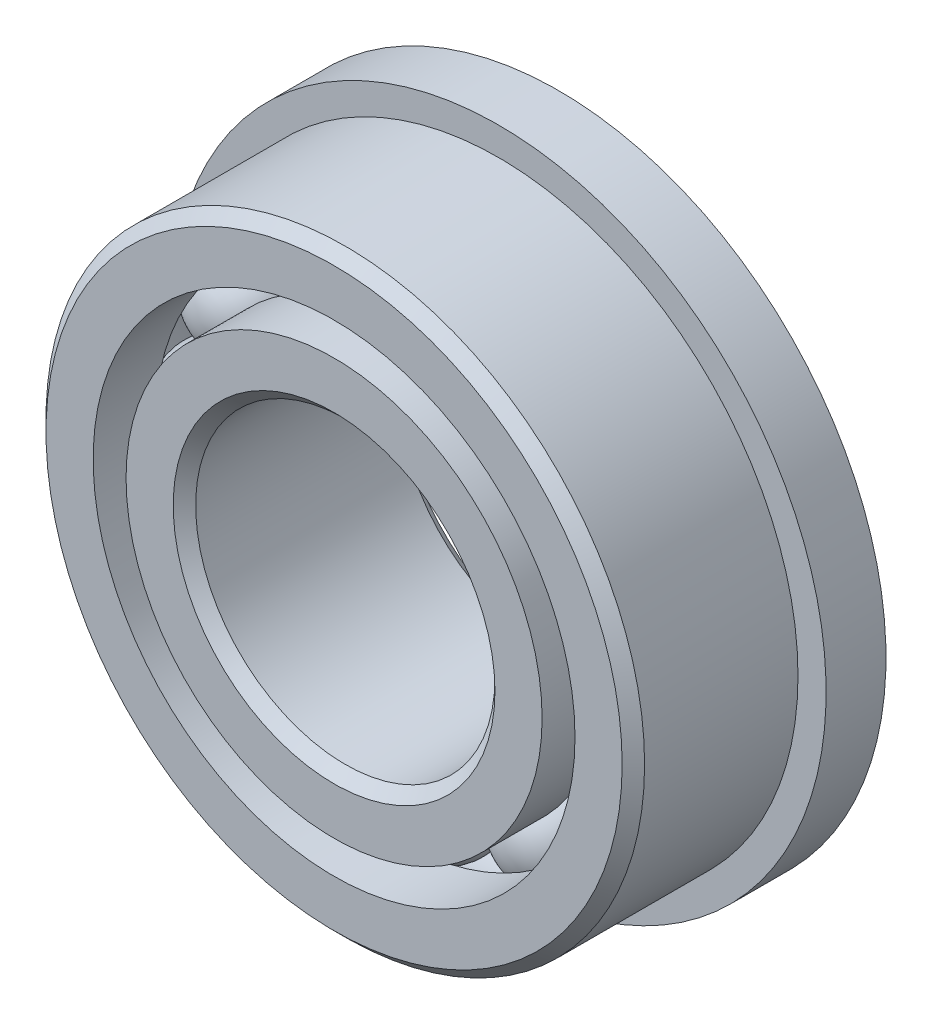
ISO-10303-21;
HEADER;
FILE_DESCRIPTION(('STEP AP214'),'2;1');
FILE_NAME('part.step','',(''),(''),'','','');
FILE_SCHEMA(('AUTOMOTIVE_DESIGN { 1 0 10303 214 1 1 1 1 }'));
ENDSEC;
DATA;
#1=APPLICATION_CONTEXT('core data for automotive mechanical design processes');
#2=APPLICATION_PROTOCOL_DEFINITION('international standard','automotive_design',2000,#1);
#3=PRODUCT_CONTEXT('',#1,'mechanical');
#4=PRODUCT('Part','Part','',(#3));
#5=PRODUCT_RELATED_PRODUCT_CATEGORY('part','',(#4));
#6=PRODUCT_DEFINITION_FORMATION('','',#4);
#7=PRODUCT_DEFINITION_CONTEXT('part definition',#1,'design');
#8=PRODUCT_DEFINITION('design','',#6,#7);
#9=PRODUCT_DEFINITION_SHAPE('','',#8);
#10=(LENGTH_UNIT() NAMED_UNIT(*) SI_UNIT(.MILLI.,.METRE.));
#11=(NAMED_UNIT(*) PLANE_ANGLE_UNIT() SI_UNIT($,.RADIAN.));
#12=(NAMED_UNIT(*) SI_UNIT($,.STERADIAN.) SOLID_ANGLE_UNIT());
#13=UNCERTAINTY_MEASURE_WITH_UNIT(LENGTH_MEASURE(1.E-05),#10,'distance_accuracy_value','');
#14=(GEOMETRIC_REPRESENTATION_CONTEXT(3) GLOBAL_UNCERTAINTY_ASSIGNED_CONTEXT((#13)) GLOBAL_UNIT_ASSIGNED_CONTEXT((#10,
#11,#12)) REPRESENTATION_CONTEXT('',''));
#15=CARTESIAN_POINT('',(0.,0.,0.));
#16=DIRECTION('',(0.,0.,1.));
#17=DIRECTION('',(1.,0.,0.));
#18=AXIS2_PLACEMENT_3D('',#15,#16,#17);
#19=CARTESIAN_POINT('',(-2.38124999999995,4.12444598552342,0.));
#20=DIRECTION('',(0.,0.,1.));
#21=DIRECTION('',(-0.499999999999989,0.866025403784445,0.));
#22=AXIS2_PLACEMENT_3D('',#19,#20,#21);
#23=SPHERICAL_SURFACE('',#22,1.11436144103197);
#24=CARTESIAN_POINT('',(-2.38124999999995,4.12444598552342,1.11436144103197));
#25=VERTEX_POINT('',#24);
#26=VERTEX_LOOP('',#25);
#27=FACE_BOUND('',#26,.T.);
#28=ADVANCED_FACE('F37',(#27),#23,.T.);
#29=CLOSED_SHELL('',(#28));
#30=MANIFOLD_SOLID_BREP('B2',#29);
#31=CARTESIAN_POINT('',(-4.12444598552336,2.38125000000005,0.));
#32=DIRECTION('',(0.,0.,1.));
#33=DIRECTION('',(-0.866025403784433,0.50000000000001,0.));
#34=AXIS2_PLACEMENT_3D('',#31,#32,#33);
#35=SPHERICAL_SURFACE('',#34,1.11436144103197);
#36=CARTESIAN_POINT('',(-4.12444598552336,2.38125000000005,1.11436144103197));
#37=VERTEX_POINT('',#36);
#38=VERTEX_LOOP('',#37);
#39=FACE_BOUND('',#38,.T.);
#40=ADVANCED_FACE('F57',(#39),#35,.T.);
#41=CLOSED_SHELL('',(#40));
#42=MANIFOLD_SOLID_BREP('B6',#41);
#43=CARTESIAN_POINT('',(-4.7625,0.,0.));
#44=DIRECTION('',(0.,0.,1.));
#45=DIRECTION('',(-1.,0.,0.));
#46=AXIS2_PLACEMENT_3D('',#43,#44,#45);
#47=SPHERICAL_SURFACE('',#46,1.11436144103197);
#48=CARTESIAN_POINT('',(-4.7625,0.,1.11436144103197));
#49=VERTEX_POINT('',#48);
#50=VERTEX_LOOP('',#49);
#51=FACE_BOUND('',#50,.T.);
#52=ADVANCED_FACE('F77',(#51),#47,.T.);
#53=CLOSED_SHELL('',(#52));
#54=MANIFOLD_SOLID_BREP('B33',#53);
#55=CARTESIAN_POINT('',(-4.12444598552341,-2.38124999999996,0.));
#56=DIRECTION('',(0.,0.,1.));
#57=DIRECTION('',(-0.866025403784443,-0.499999999999992,0.));
#58=AXIS2_PLACEMENT_3D('',#55,#56,#57);
#59=SPHERICAL_SURFACE('',#58,1.11436144103197);
#60=CARTESIAN_POINT('',(-4.12444598552341,-2.38124999999996,1.11436144103197));
#61=VERTEX_POINT('',#60);
#62=VERTEX_LOOP('',#61);
#63=FACE_BOUND('',#62,.T.);
#64=ADVANCED_FACE('F97',(#63),#59,.T.);
#65=CLOSED_SHELL('',(#64));
#66=MANIFOLD_SOLID_BREP('B53',#65);
#67=CARTESIAN_POINT('',(-2.38125000000003,-4.12444598552337,0.));
#68=DIRECTION('',(0.,0.,1.));
#69=DIRECTION('',(-0.500000000000007,-0.866025403784435,0.));
#70=AXIS2_PLACEMENT_3D('',#67,#68,#69);
#71=SPHERICAL_SURFACE('',#70,1.11436144103197);
#72=CARTESIAN_POINT('',(-2.38125000000003,-4.12444598552337,1.11436144103197));
#73=VERTEX_POINT('',#72);
#74=VERTEX_LOOP('',#73);
#75=FACE_BOUND('',#74,.T.);
#76=ADVANCED_FACE('F117',(#75),#71,.T.);
#77=CLOSED_SHELL('',(#76));
#78=MANIFOLD_SOLID_BREP('B73',#77);
#79=CARTESIAN_POINT('',(0.,-4.7625,0.));
#80=DIRECTION('',(0.,0.,1.));
#81=DIRECTION('',(0.,-1.,0.));
#82=AXIS2_PLACEMENT_3D('',#79,#80,#81);
#83=SPHERICAL_SURFACE('',#82,1.11436144103197);
#84=CARTESIAN_POINT('',(0.,-4.7625,1.11436144103197));
#85=VERTEX_POINT('',#84);
#86=VERTEX_LOOP('',#85);
#87=FACE_BOUND('',#86,.T.);
#88=ADVANCED_FACE('F137',(#87),#83,.T.);
#89=CLOSED_SHELL('',(#88));
#90=MANIFOLD_SOLID_BREP('B93',#89);
#91=CARTESIAN_POINT('',(2.38124999999998,-4.1244459855234,0.));
#92=DIRECTION('',(0.,0.,1.));
#93=DIRECTION('',(0.499999999999995,-0.866025403784442,0.));
#94=AXIS2_PLACEMENT_3D('',#91,#92,#93);
#95=SPHERICAL_SURFACE('',#94,1.11436144103197);
#96=CARTESIAN_POINT('',(2.38124999999998,-4.1244459855234,1.11436144103197));
#97=VERTEX_POINT('',#96);
#98=VERTEX_LOOP('',#97);
#99=FACE_BOUND('',#98,.T.);
#100=ADVANCED_FACE('F157',(#99),#95,.T.);
#101=CLOSED_SHELL('',(#100));
#102=MANIFOLD_SOLID_BREP('B113',#101);
#103=CARTESIAN_POINT('',(4.12444598552338,-2.38125000000002,0.));
#104=DIRECTION('',(0.,0.,1.));
#105=DIRECTION('',(0.866025403784436,-0.500000000000004,0.));
#106=AXIS2_PLACEMENT_3D('',#103,#104,#105);
#107=SPHERICAL_SURFACE('',#106,1.11436144103197);
#108=CARTESIAN_POINT('',(4.12444598552338,-2.38125000000002,1.11436144103197));
#109=VERTEX_POINT('',#108);
#110=VERTEX_LOOP('',#109);
#111=FACE_BOUND('',#110,.T.);
#112=ADVANCED_FACE('F177',(#111),#107,.T.);
#113=CLOSED_SHELL('',(#112));
#114=MANIFOLD_SOLID_BREP('B133',#113);
#115=CARTESIAN_POINT('',(4.7625,0.,0.));
#116=DIRECTION('',(0.,0.,1.));
#117=DIRECTION('',(1.,0.,0.));
#118=AXIS2_PLACEMENT_3D('',#115,#116,#117);
#119=SPHERICAL_SURFACE('',#118,1.11436144103197);
#120=CARTESIAN_POINT('',(4.7625,0.,1.11436144103197));
#121=VERTEX_POINT('',#120);
#122=VERTEX_LOOP('',#121);
#123=FACE_BOUND('',#122,.T.);
#124=ADVANCED_FACE('F197',(#123),#119,.T.);
#125=CLOSED_SHELL('',(#124));
#126=MANIFOLD_SOLID_BREP('B153',#125);
#127=CARTESIAN_POINT('',(4.12444598552339,2.38124999999999,0.));
#128=DIRECTION('',(0.,0.,1.));
#129=DIRECTION('',(0.86602540378444,0.499999999999998,0.));
#130=AXIS2_PLACEMENT_3D('',#127,#128,#129);
#131=SPHERICAL_SURFACE('',#130,1.11436144103197);
#132=CARTESIAN_POINT('',(4.12444598552339,2.38124999999999,1.11436144103197));
#133=VERTEX_POINT('',#132);
#134=VERTEX_LOOP('',#133);
#135=FACE_BOUND('',#134,.T.);
#136=ADVANCED_FACE('F217',(#135),#131,.T.);
#137=CLOSED_SHELL('',(#136));
#138=MANIFOLD_SOLID_BREP('B173',#137);
#139=CARTESIAN_POINT('',(2.38125,4.12444598552339,0.));
#140=DIRECTION('',(0.,0.,1.));
#141=DIRECTION('',(0.500000000000001,0.866025403784438,0.));
#142=AXIS2_PLACEMENT_3D('',#139,#140,#141);
#143=SPHERICAL_SURFACE('',#142,1.11436144103197);
#144=CARTESIAN_POINT('',(2.38125,4.12444598552339,1.11436144103197));
#145=VERTEX_POINT('',#144);
#146=VERTEX_LOOP('',#145);
#147=FACE_BOUND('',#146,.T.);
#148=ADVANCED_FACE('F237',(#147),#143,.T.);
#149=CLOSED_SHELL('',(#148));
#150=MANIFOLD_SOLID_BREP('B193',#149);
#151=CARTESIAN_POINT('',(0.,4.7625,0.));
#152=DIRECTION('',(0.,0.,1.));
#153=DIRECTION('',(0.,1.,0.));
#154=AXIS2_PLACEMENT_3D('',#151,#152,#153);
#155=SPHERICAL_SURFACE('',#154,1.11436144103197);
#156=CARTESIAN_POINT('',(0.,4.7625,1.11436144103197));
#157=VERTEX_POINT('',#156);
#158=VERTEX_LOOP('',#157);
#159=FACE_BOUND('',#158,.T.);
#160=ADVANCED_FACE('F260',(#159),#155,.T.);
#161=CLOSED_SHELL('',(#160));
#162=MANIFOLD_SOLID_BREP('B213',#161);
#163=CARTESIAN_POINT('',(0.,4.4135989010989,2.38125));
#164=DIRECTION('',(0.,0.,-1.));
#165=DIRECTION('',(-1.,0.,0.));
#166=AXIS2_PLACEMENT_3D('',#163,#164,#165);
#167=PLANE('',#166);
#168=CARTESIAN_POINT('',(0.,0.,2.38125));
#169=DIRECTION('',(0.,0.,1.));
#170=DIRECTION('',(1.,0.,0.));
#171=AXIS2_PLACEMENT_3D('',#168,#169,#170);
#172=CIRCLE('',#171,3.413125);
#173=CARTESIAN_POINT('',(3.413125,0.,2.38125));
#174=VERTEX_POINT('',#173);
#175=EDGE_CURVE('E308',#174,#174,#172,.T.);
#176=ORIENTED_EDGE('',*,*,#175,.F.);
#177=EDGE_LOOP('',(#176));
#178=FACE_BOUND('',#177,.T.);
#179=CARTESIAN_POINT('',(0.,0.,2.38125));
#180=DIRECTION('',(0.,0.,1.));
#181=DIRECTION('',(1.,0.,0.));
#182=AXIS2_PLACEMENT_3D('',#179,#180,#181);
#183=CIRCLE('',#182,4.4135989010989);
#184=CARTESIAN_POINT('',(4.4135989010989,0.,2.38125));
#185=VERTEX_POINT('',#184);
#186=EDGE_CURVE('E259',#185,#185,#183,.T.);
#187=ORIENTED_EDGE('',*,*,#186,.T.);
#188=EDGE_LOOP('',(#187));
#189=FACE_BOUND('',#188,.T.);
#190=ADVANCED_FACE('F280',(#178,#189),#167,.F.);
#191=CARTESIAN_POINT('',(0.,0.,2.38125));
#192=DIRECTION('',(0.,0.,1.));
#193=DIRECTION('',(1.,0.,0.));
#194=AXIS2_PLACEMENT_3D('',#191,#192,#193);
#195=CYLINDRICAL_SURFACE('',#194,4.4135989010989);
#196=ORIENTED_EDGE('',*,*,#186,.F.);
#197=EDGE_LOOP('',(#196));
#198=FACE_BOUND('',#197,.T.);
#199=CARTESIAN_POINT('',(0.,0.,1.05833333333333));
#200=DIRECTION('',(0.,0.,1.));
#201=DIRECTION('',(1.,0.,0.));
#202=AXIS2_PLACEMENT_3D('',#199,#200,#201);
#203=CIRCLE('',#202,4.4135989010989);
#204=CARTESIAN_POINT('',(4.4135989010989,0.,1.05833333333333));
#205=VERTEX_POINT('',#204);
#206=EDGE_CURVE('E286',#205,#205,#203,.T.);
#207=ORIENTED_EDGE('',*,*,#206,.T.);
#208=EDGE_LOOP('',(#207));
#209=FACE_BOUND('',#208,.T.);
#210=ADVANCED_FACE('F315',(#198,#209),#195,.T.);
#211=CARTESIAN_POINT('',(0.,0.,0.));
#212=DIRECTION('',(0.,0.,1.));
#213=DIRECTION('',(1.,0.,0.));
#214=AXIS2_PLACEMENT_3D('',#211,#212,#213);
#215=TOROIDAL_SURFACE('',#214,4.7625,1.11436144103197);
#216=ORIENTED_EDGE('',*,*,#206,.F.);
#217=EDGE_LOOP('',(#216));
#218=FACE_BOUND('',#217,.T.);
#219=CARTESIAN_POINT('',(0.,0.,-1.05833333333333));
#220=DIRECTION('',(0.,0.,1.));
#221=DIRECTION('',(1.,0.,0.));
#222=AXIS2_PLACEMENT_3D('',#219,#220,#221);
#223=CIRCLE('',#222,4.4135989010989);
#224=CARTESIAN_POINT('',(4.4135989010989,0.,-1.05833333333333));
#225=VERTEX_POINT('',#224);
#226=EDGE_CURVE('E290',#225,#225,#223,.T.);
#227=ORIENTED_EDGE('',*,*,#226,.T.);
#228=EDGE_LOOP('',(#227));
#229=FACE_BOUND('',#228,.T.);
#230=ADVANCED_FACE('F319',(#218,#229),#215,.F.);
#231=CARTESIAN_POINT('',(0.,0.,2.38125));
#232=DIRECTION('',(0.,0.,1.));
#233=DIRECTION('',(1.,0.,0.));
#234=AXIS2_PLACEMENT_3D('',#231,#232,#233);
#235=CYLINDRICAL_SURFACE('',#234,4.4135989010989);
#236=ORIENTED_EDGE('',*,*,#226,.F.);
#237=EDGE_LOOP('',(#236));
#238=FACE_BOUND('',#237,.T.);
#239=CARTESIAN_POINT('',(0.,0.,-2.38125));
#240=DIRECTION('',(0.,0.,1.));
#241=DIRECTION('',(1.,0.,0.));
#242=AXIS2_PLACEMENT_3D('',#239,#240,#241);
#243=CIRCLE('',#242,4.4135989010989);
#244=CARTESIAN_POINT('',(4.4135989010989,0.,-2.38125));
#245=VERTEX_POINT('',#244);
#246=EDGE_CURVE('E294',#245,#245,#243,.T.);
#247=ORIENTED_EDGE('',*,*,#246,.T.);
#248=EDGE_LOOP('',(#247));
#249=FACE_BOUND('',#248,.T.);
#250=ADVANCED_FACE('F324',(#238,#249),#235,.T.);
#251=CARTESIAN_POINT('',(0.,3.413125,-2.38125));
#252=DIRECTION('',(0.,0.,1.));
#253=DIRECTION('',(1.,0.,0.));
#254=AXIS2_PLACEMENT_3D('',#251,#252,#253);
#255=PLANE('',#254);
#256=ORIENTED_EDGE('',*,*,#246,.F.);
#257=EDGE_LOOP('',(#256));
#258=FACE_BOUND('',#257,.T.);
#259=CARTESIAN_POINT('',(0.,0.,-2.38125));
#260=DIRECTION('',(0.,0.,1.));
#261=DIRECTION('',(1.,0.,0.));
#262=AXIS2_PLACEMENT_3D('',#259,#260,#261);
#263=CIRCLE('',#262,3.413125);
#264=CARTESIAN_POINT('',(3.413125,0.,-2.38125));
#265=VERTEX_POINT('',#264);
#266=EDGE_CURVE('E299',#265,#265,#263,.T.);
#267=ORIENTED_EDGE('',*,*,#266,.T.);
#268=EDGE_LOOP('',(#267));
#269=FACE_BOUND('',#268,.T.);
#270=ADVANCED_FACE('F330',(#258,#269),#255,.F.);
#271=CARTESIAN_POINT('',(0.,0.,-2.143125));
#272=DIRECTION('',(0.,0.,-1.));
#273=DIRECTION('',(-1.,0.,0.));
#274=AXIS2_PLACEMENT_3D('',#271,#272,#273);
#275=CONICAL_SURFACE('',#274,3.175,0.785398163397447);
#276=ORIENTED_EDGE('',*,*,#266,.F.);
#277=EDGE_LOOP('',(#276));
#278=FACE_BOUND('',#277,.T.);
#279=CARTESIAN_POINT('',(0.,0.,-2.143125));
#280=DIRECTION('',(0.,0.,1.));
#281=DIRECTION('',(1.,0.,0.));
#282=AXIS2_PLACEMENT_3D('',#279,#280,#281);
#283=CIRCLE('',#282,3.175);
#284=CARTESIAN_POINT('',(3.175,0.,-2.143125));
#285=VERTEX_POINT('',#284);
#286=EDGE_CURVE('E302',#285,#285,#283,.T.);
#287=ORIENTED_EDGE('',*,*,#286,.T.);
#288=EDGE_LOOP('',(#287));
#289=FACE_BOUND('',#288,.T.);
#290=ADVANCED_FACE('F334',(#278,#289),#275,.F.);
#291=CARTESIAN_POINT('',(0.,0.,2.38125));
#292=DIRECTION('',(0.,0.,1.));
#293=DIRECTION('',(1.,0.,0.));
#294=AXIS2_PLACEMENT_3D('',#291,#292,#293);
#295=CYLINDRICAL_SURFACE('',#294,3.175);
#296=ORIENTED_EDGE('',*,*,#286,.F.);
#297=EDGE_LOOP('',(#296));
#298=FACE_BOUND('',#297,.T.);
#299=CARTESIAN_POINT('',(0.,0.,2.143125));
#300=DIRECTION('',(0.,0.,1.));
#301=DIRECTION('',(1.,0.,0.));
#302=AXIS2_PLACEMENT_3D('',#299,#300,#301);
#303=CIRCLE('',#302,3.175);
#304=CARTESIAN_POINT('',(3.175,0.,2.143125));
#305=VERTEX_POINT('',#304);
#306=EDGE_CURVE('E305',#305,#305,#303,.T.);
#307=ORIENTED_EDGE('',*,*,#306,.T.);
#308=EDGE_LOOP('',(#307));
#309=FACE_BOUND('',#308,.T.);
#310=ADVANCED_FACE('F338',(#298,#309),#295,.F.);
#311=CARTESIAN_POINT('',(0.,0.,2.38125));
#312=DIRECTION('',(0.,0.,1.));
#313=DIRECTION('',(1.,0.,0.));
#314=AXIS2_PLACEMENT_3D('',#311,#312,#313);
#315=CONICAL_SURFACE('',#314,3.413125,0.785398163397451);
#316=ORIENTED_EDGE('',*,*,#306,.F.);
#317=EDGE_LOOP('',(#316));
#318=FACE_BOUND('',#317,.T.);
#319=ORIENTED_EDGE('',*,*,#175,.T.);
#320=EDGE_LOOP('',(#319));
#321=FACE_BOUND('',#320,.T.);
#322=ADVANCED_FACE('F312',(#318,#321),#315,.F.);
#323=CLOSED_SHELL('',(#190,#210,#230,#250,#270,#290,#310,#322));
#324=MANIFOLD_SOLID_BREP('B233',#323);
#325=CARTESIAN_POINT('',(0.,0.,2.143125));
#326=DIRECTION('',(0.,0.,-1.));
#327=DIRECTION('',(-1.,0.,0.));
#328=AXIS2_PLACEMENT_3D('',#325,#326,#327);
#329=CONICAL_SURFACE('',#328,6.35,0.785398163397447);
#330=CARTESIAN_POINT('',(0.,0.,2.38125));
#331=DIRECTION('',(0.,0.,1.));
#332=DIRECTION('',(1.,0.,0.));
#333=AXIS2_PLACEMENT_3D('',#330,#331,#332);
#334=CIRCLE('',#333,6.111875);
#335=CARTESIAN_POINT('',(6.111875,0.,2.38125));
#336=VERTEX_POINT('',#335);
#337=EDGE_CURVE('E424',#336,#336,#334,.T.);
#338=ORIENTED_EDGE('',*,*,#337,.F.);
#339=EDGE_LOOP('',(#338));
#340=FACE_BOUND('',#339,.T.);
#341=CARTESIAN_POINT('',(0.,0.,2.143125));
#342=DIRECTION('',(0.,0.,1.));
#343=DIRECTION('',(1.,0.,0.));
#344=AXIS2_PLACEMENT_3D('',#341,#342,#343);
#345=CIRCLE('',#344,6.35);
#346=CARTESIAN_POINT('',(6.35,0.,2.143125));
#347=VERTEX_POINT('',#346);
#348=EDGE_CURVE('E279',#347,#347,#345,.T.);
#349=ORIENTED_EDGE('',*,*,#348,.T.);
#350=EDGE_LOOP('',(#349));
#351=FACE_BOUND('',#350,.T.);
#352=ADVANCED_FACE('F402',(#340,#351),#329,.T.);
#353=CARTESIAN_POINT('',(0.,0.,2.38125));
#354=DIRECTION('',(0.,0.,1.));
#355=DIRECTION('',(1.,0.,0.));
#356=AXIS2_PLACEMENT_3D('',#353,#354,#355);
#357=CYLINDRICAL_SURFACE('',#356,6.35);
#358=CARTESIAN_POINT('',(0.,0.,-1.11125));
#359=DIRECTION('',(0.,0.,1.));
#360=DIRECTION('',(1.,0.,0.));
#361=AXIS2_PLACEMENT_3D('',#358,#359,#360);
#362=CIRCLE('',#361,6.35);
#363=CARTESIAN_POINT('',(6.35,0.,-1.11125));
#364=VERTEX_POINT('',#363);
#365=EDGE_CURVE('E405',#364,#364,#362,.T.);
#366=ORIENTED_EDGE('',*,*,#365,.T.);
#367=EDGE_LOOP('',(#366));
#368=FACE_BOUND('',#367,.T.);
#369=ORIENTED_EDGE('',*,*,#348,.F.);
#370=EDGE_LOOP('',(#369));
#371=FACE_BOUND('',#370,.T.);
#372=ADVANCED_FACE('F445',(#368,#371),#357,.T.);
#373=CARTESIAN_POINT('',(0.,6.111875,-2.38125));
#374=DIRECTION('',(0.,0.,1.));
#375=DIRECTION('',(1.,0.,0.));
#376=AXIS2_PLACEMENT_3D('',#373,#374,#375);
#377=PLANE('',#376);
#378=CARTESIAN_POINT('',(0.,0.,-2.38125));
#379=DIRECTION('',(0.,0.,1.));
#380=DIRECTION('',(1.,0.,0.));
#381=AXIS2_PLACEMENT_3D('',#378,#379,#380);
#382=CIRCLE('',#381,5.1114010989011);
#383=CARTESIAN_POINT('',(5.1114010989011,0.,-2.38125));
#384=VERTEX_POINT('',#383);
#385=EDGE_CURVE('E409',#384,#384,#382,.T.);
#386=ORIENTED_EDGE('',*,*,#385,.T.);
#387=EDGE_LOOP('',(#386));
#388=FACE_BOUND('',#387,.T.);
#389=CARTESIAN_POINT('',(0.,0.,-2.38125));
#390=DIRECTION('',(0.,0.,-1.));
#391=DIRECTION('',(-1.,0.,0.));
#392=AXIS2_PLACEMENT_3D('',#389,#390,#391);
#393=CIRCLE('',#392,6.9469);
#394=CARTESIAN_POINT('',(-6.9469,0.,-2.38125));
#395=VERTEX_POINT('',#394);
#396=EDGE_CURVE('E427',#395,#395,#393,.T.);
#397=ORIENTED_EDGE('',*,*,#396,.T.);
#398=EDGE_LOOP('',(#397));
#399=FACE_BOUND('',#398,.T.);
#400=ADVANCED_FACE('F448',(#388,#399),#377,.F.);
#401=CARTESIAN_POINT('',(0.,0.,2.38125));
#402=DIRECTION('',(0.,0.,1.));
#403=DIRECTION('',(1.,0.,0.));
#404=AXIS2_PLACEMENT_3D('',#401,#402,#403);
#405=CYLINDRICAL_SURFACE('',#404,5.1114010989011);
#406=ORIENTED_EDGE('',*,*,#385,.F.);
#407=EDGE_LOOP('',(#406));
#408=FACE_BOUND('',#407,.T.);
#409=CARTESIAN_POINT('',(0.,0.,-1.05833333333333));
#410=DIRECTION('',(0.,0.,1.));
#411=DIRECTION('',(1.,0.,0.));
#412=AXIS2_PLACEMENT_3D('',#409,#410,#411);
#413=CIRCLE('',#412,5.1114010989011);
#414=CARTESIAN_POINT('',(5.1114010989011,0.,-1.05833333333333));
#415=VERTEX_POINT('',#414);
#416=EDGE_CURVE('E413',#415,#415,#413,.T.);
#417=ORIENTED_EDGE('',*,*,#416,.T.);
#418=EDGE_LOOP('',(#417));
#419=FACE_BOUND('',#418,.T.);
#420=ADVANCED_FACE('F453',(#408,#419),#405,.F.);
#421=CARTESIAN_POINT('',(0.,0.,0.));
#422=DIRECTION('',(0.,0.,1.));
#423=DIRECTION('',(1.,0.,0.));
#424=AXIS2_PLACEMENT_3D('',#421,#422,#423);
#425=TOROIDAL_SURFACE('',#424,4.7625,1.11436144103197);
#426=ORIENTED_EDGE('',*,*,#416,.F.);
#427=EDGE_LOOP('',(#426));
#428=FACE_BOUND('',#427,.T.);
#429=CARTESIAN_POINT('',(0.,0.,1.05833333333333));
#430=DIRECTION('',(0.,0.,1.));
#431=DIRECTION('',(1.,0.,0.));
#432=AXIS2_PLACEMENT_3D('',#429,#430,#431);
#433=CIRCLE('',#432,5.1114010989011);
#434=CARTESIAN_POINT('',(5.1114010989011,0.,1.05833333333333));
#435=VERTEX_POINT('',#434);
#436=EDGE_CURVE('E418',#435,#435,#433,.T.);
#437=ORIENTED_EDGE('',*,*,#436,.T.);
#438=EDGE_LOOP('',(#437));
#439=FACE_BOUND('',#438,.T.);
#440=ADVANCED_FACE('F460',(#428,#439),#425,.F.);
#441=CARTESIAN_POINT('',(0.,0.,2.38125));
#442=DIRECTION('',(0.,0.,1.));
#443=DIRECTION('',(1.,0.,0.));
#444=AXIS2_PLACEMENT_3D('',#441,#442,#443);
#445=CYLINDRICAL_SURFACE('',#444,5.1114010989011);
#446=ORIENTED_EDGE('',*,*,#436,.F.);
#447=EDGE_LOOP('',(#446));
#448=FACE_BOUND('',#447,.T.);
#449=CARTESIAN_POINT('',(0.,0.,2.38125));
#450=DIRECTION('',(0.,0.,1.));
#451=DIRECTION('',(1.,0.,0.));
#452=AXIS2_PLACEMENT_3D('',#449,#450,#451);
#453=CIRCLE('',#452,5.1114010989011);
#454=CARTESIAN_POINT('',(5.1114010989011,0.,2.38125));
#455=VERTEX_POINT('',#454);
#456=EDGE_CURVE('E421',#455,#455,#453,.T.);
#457=ORIENTED_EDGE('',*,*,#456,.T.);
#458=EDGE_LOOP('',(#457));
#459=FACE_BOUND('',#458,.T.);
#460=ADVANCED_FACE('F464',(#448,#459),#445,.F.);
#461=CARTESIAN_POINT('',(0.,6.111875,2.38125));
#462=DIRECTION('',(0.,0.,-1.));
#463=DIRECTION('',(-1.,0.,0.));
#464=AXIS2_PLACEMENT_3D('',#461,#462,#463);
#465=PLANE('',#464);
#466=ORIENTED_EDGE('',*,*,#456,.F.);
#467=EDGE_LOOP('',(#466));
#468=FACE_BOUND('',#467,.T.);
#469=ORIENTED_EDGE('',*,*,#337,.T.);
#470=EDGE_LOOP('',(#469));
#471=FACE_BOUND('',#470,.T.);
#472=ADVANCED_FACE('F440',(#468,#471),#465,.F.);
#473=CARTESIAN_POINT('',(0.,5.61163804945055,-1.11125));
#474=DIRECTION('',(0.,0.,1.));
#475=DIRECTION('',(1.,0.,0.));
#476=AXIS2_PLACEMENT_3D('',#473,#474,#475);
#477=PLANE('',#476);
#478=CARTESIAN_POINT('',(0.,0.,-1.11125));
#479=DIRECTION('',(0.,0.,-1.));
#480=DIRECTION('',(-1.,0.,0.));
#481=AXIS2_PLACEMENT_3D('',#478,#479,#480);
#482=CIRCLE('',#481,6.9469);
#483=CARTESIAN_POINT('',(-6.9469,0.,-1.11125));
#484=VERTEX_POINT('',#483);
#485=EDGE_CURVE('E430',#484,#484,#482,.T.);
#486=ORIENTED_EDGE('',*,*,#485,.F.);
#487=EDGE_LOOP('',(#486));
#488=FACE_BOUND('',#487,.T.);
#489=ORIENTED_EDGE('',*,*,#365,.F.);
#490=EDGE_LOOP('',(#489));
#491=FACE_BOUND('',#490,.T.);
#492=ADVANCED_FACE('F437',(#488,#491),#477,.T.);
#493=CARTESIAN_POINT('',(0.,0.,-2.38125));
#494=DIRECTION('',(0.,0.,-1.));
#495=DIRECTION('',(-1.,0.,0.));
#496=AXIS2_PLACEMENT_3D('',#493,#494,#495);
#497=CYLINDRICAL_SURFACE('',#496,6.9469);
#498=ORIENTED_EDGE('',*,*,#485,.T.);
#499=EDGE_LOOP('',(#498));
#500=FACE_BOUND('',#499,.T.);
#501=ORIENTED_EDGE('',*,*,#396,.F.);
#502=EDGE_LOOP('',(#501));
#503=FACE_BOUND('',#502,.T.);
#504=ADVANCED_FACE('F434',(#500,#503),#497,.T.);
#505=CLOSED_SHELL('',(#352,#372,#400,#420,#440,#460,#472,#492,#504));
#506=MANIFOLD_SOLID_BREP('B254',#505);
#507=ADVANCED_BREP_SHAPE_REPRESENTATION('',(#18,#30,#42,#54,#66,#78,#90,#102,#114,#126,#138,
#150,#162,#324,#506),#14);
#508=SHAPE_DEFINITION_REPRESENTATION(#9,#507);
ENDSEC;
END-ISO-10303-21;
